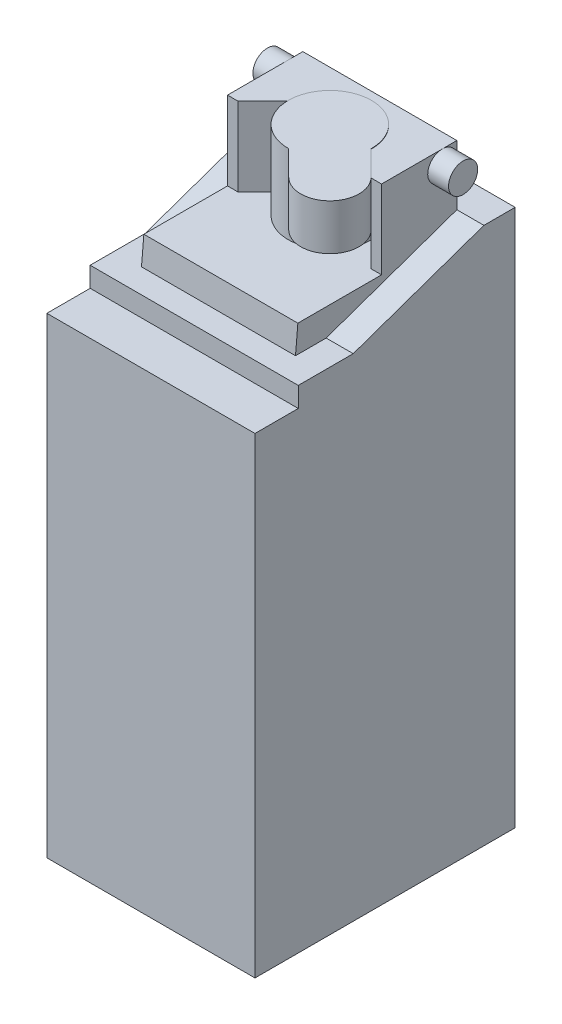
ISO-10303-21;
HEADER;
FILE_DESCRIPTION(('STEP AP214'),'2;1');
FILE_NAME('part.step','',(''),(''),'','','');
FILE_SCHEMA(('AUTOMOTIVE_DESIGN { 1 0 10303 214 1 1 1 1 }'));
ENDSEC;
DATA;
#1=APPLICATION_CONTEXT('core data for automotive mechanical design processes');
#2=APPLICATION_PROTOCOL_DEFINITION('international standard','automotive_design',2000,#1);
#3=PRODUCT_CONTEXT('',#1,'mechanical');
#4=PRODUCT('Part','Part','',(#3));
#5=PRODUCT_RELATED_PRODUCT_CATEGORY('part','',(#4));
#6=PRODUCT_DEFINITION_FORMATION('','',#4);
#7=PRODUCT_DEFINITION_CONTEXT('part definition',#1,'design');
#8=PRODUCT_DEFINITION('design','',#6,#7);
#9=PRODUCT_DEFINITION_SHAPE('','',#8);
#10=(LENGTH_UNIT() NAMED_UNIT(*) SI_UNIT(.MILLI.,.METRE.));
#11=(NAMED_UNIT(*) PLANE_ANGLE_UNIT() SI_UNIT($,.RADIAN.));
#12=(NAMED_UNIT(*) SI_UNIT($,.STERADIAN.) SOLID_ANGLE_UNIT());
#13=UNCERTAINTY_MEASURE_WITH_UNIT(LENGTH_MEASURE(1.E-05),#10,'distance_accuracy_value','');
#14=(GEOMETRIC_REPRESENTATION_CONTEXT(3) GLOBAL_UNCERTAINTY_ASSIGNED_CONTEXT((#13)) GLOBAL_UNIT_ASSIGNED_CONTEXT((#10,
#11,#12)) REPRESENTATION_CONTEXT('',''));
#15=CARTESIAN_POINT('',(0.,0.,0.));
#16=DIRECTION('',(0.,0.,1.));
#17=DIRECTION('',(1.,0.,0.));
#18=AXIS2_PLACEMENT_3D('',#15,#16,#17);
#19=CARTESIAN_POINT('',(3.7,28.7,-7.38));
#20=DIRECTION('',(0.,-1.,0.));
#21=DIRECTION('',(0.,0.,-1.));
#22=AXIS2_PLACEMENT_3D('',#19,#20,#21);
#23=PLANE('',#22);
#24=CARTESIAN_POINT('',(0.,28.7,-8.6));
#25=DIRECTION('',(0.,-1.,0.));
#26=DIRECTION('',(0.,0.,-1.));
#27=AXIS2_PLACEMENT_3D('',#24,#25,#26);
#28=CIRCLE('',#27,2.);
#29=CARTESIAN_POINT('',(1.99990098524558,28.7,-8.58009901475445));
#30=VERTEX_POINT('',#29);
#31=CARTESIAN_POINT('',(-1.99990098524558,28.7,-8.5800990147544));
#32=VERTEX_POINT('',#31);
#33=EDGE_CURVE('E39',#30,#32,#28,.F.);
#34=ORIENTED_EDGE('',*,*,#33,.F.);
#35=DIRECTION('',(-0.707106781186551,0.,-0.707106781186544));
#36=VECTOR('',#35,1.);
#37=CARTESIAN_POINT('',(0.,28.7,-10.58));
#38=LINE('',#37,#36);
#39=CARTESIAN_POINT('',(3.20000000000005,28.7,-7.38));
#40=VERTEX_POINT('',#39);
#41=EDGE_CURVE('E226',#40,#30,#38,.T.);
#42=ORIENTED_EDGE('',*,*,#41,.F.);
#43=DIRECTION('',(-1.,0.,0.));
#44=VECTOR('',#43,1.);
#45=CARTESIAN_POINT('',(3.7,28.7,-7.38));
#46=LINE('',#45,#44);
#47=CARTESIAN_POINT('',(3.7,28.7,-7.38));
#48=VERTEX_POINT('',#47);
#49=EDGE_CURVE('E327',#48,#40,#46,.T.);
#50=ORIENTED_EDGE('',*,*,#49,.F.);
#51=DIRECTION('',(0.,0.,1.));
#52=VECTOR('',#51,1.);
#53=CARTESIAN_POINT('',(3.7,28.7,-7.38));
#54=LINE('',#53,#52);
#55=CARTESIAN_POINT('',(3.7,28.7,-10.3));
#56=VERTEX_POINT('',#55);
#57=EDGE_CURVE('E322',#56,#48,#54,.T.);
#58=ORIENTED_EDGE('',*,*,#57,.F.);
#59=CARTESIAN_POINT('',(3.7,28.7,-11.));
#60=VERTEX_POINT('',#59);
#61=EDGE_CURVE('E323',#60,#56,#54,.T.);
#62=ORIENTED_EDGE('',*,*,#61,.F.);
#63=DIRECTION('',(-1.,0.,0.));
#64=VECTOR('',#63,1.);
#65=CARTESIAN_POINT('',(3.7,28.7,-11.));
#66=LINE('',#65,#64);
#67=CARTESIAN_POINT('',(-3.7,28.7,-11.));
#68=VERTEX_POINT('',#67);
#69=EDGE_CURVE('E330',#60,#68,#66,.T.);
#70=ORIENTED_EDGE('',*,*,#69,.T.);
#71=DIRECTION('',(0.,0.,1.));
#72=VECTOR('',#71,1.);
#73=CARTESIAN_POINT('',(-3.7,28.7,-7.38));
#74=LINE('',#73,#72);
#75=CARTESIAN_POINT('',(-3.7,28.7,-10.3));
#76=VERTEX_POINT('',#75);
#77=EDGE_CURVE('E259',#68,#76,#74,.T.);
#78=ORIENTED_EDGE('',*,*,#77,.T.);
#79=CARTESIAN_POINT('',(-3.7,28.7,-7.38));
#80=VERTEX_POINT('',#79);
#81=EDGE_CURVE('E258',#76,#80,#74,.T.);
#82=ORIENTED_EDGE('',*,*,#81,.T.);
#83=CARTESIAN_POINT('',(-3.19999999999995,28.7,-7.38));
#84=VERTEX_POINT('',#83);
#85=EDGE_CURVE('E326',#84,#80,#46,.T.);
#86=ORIENTED_EDGE('',*,*,#85,.F.);
#87=DIRECTION('',(-0.707106781186541,0.,0.707106781186554));
#88=VECTOR('',#87,1.);
#89=CARTESIAN_POINT('',(-3.19999999999995,28.7,-7.38));
#90=LINE('',#89,#88);
#91=EDGE_CURVE('E229',#32,#84,#90,.T.);
#92=ORIENTED_EDGE('',*,*,#91,.F.);
#93=EDGE_LOOP('',(#34,#42,#50,#58,#62,#70,#78,#82,#86,#92));
#94=FACE_BOUND('',#93,.T.);
#95=ADVANCED_FACE('F16',(#94),#23,.F.);
#96=CARTESIAN_POINT('',(3.7,24.92,-3.36));
#97=DIRECTION('',(0.,-1.,0.));
#98=DIRECTION('',(0.,0.,-1.));
#99=AXIS2_PLACEMENT_3D('',#96,#97,#98);
#100=PLANE('',#99);
#101=CARTESIAN_POINT('',(0.,24.92,-8.6));
#102=DIRECTION('',(0.,1.,0.));
#103=DIRECTION('',(0.,0.,1.));
#104=AXIS2_PLACEMENT_3D('',#101,#102,#103);
#105=CIRCLE('',#104,2.);
#106=CARTESIAN_POINT('',(-1.99990098524559,24.92,-8.5800990147544));
#107=VERTEX_POINT('',#106);
#108=CARTESIAN_POINT('',(1.99990098524558,24.92,-8.58009901475445));
#109=VERTEX_POINT('',#108);
#110=EDGE_CURVE('E214',#107,#109,#105,.T.);
#111=ORIENTED_EDGE('',*,*,#110,.F.);
#112=DIRECTION('',(-0.707106781186541,0.,0.707106781186554));
#113=VECTOR('',#112,1.);
#114=CARTESIAN_POINT('',(-3.19999999999996,24.92,-7.38));
#115=LINE('',#114,#113);
#116=CARTESIAN_POINT('',(-3.19999999999996,24.92,-7.38));
#117=VERTEX_POINT('',#116);
#118=EDGE_CURVE('E224',#107,#117,#115,.T.);
#119=ORIENTED_EDGE('',*,*,#118,.T.);
#120=DIRECTION('',(-1.,0.,0.));
#121=VECTOR('',#120,1.);
#122=CARTESIAN_POINT('',(3.7,24.92,-7.38));
#123=LINE('',#122,#121);
#124=CARTESIAN_POINT('',(-3.7,24.92,-7.38));
#125=VERTEX_POINT('',#124);
#126=EDGE_CURVE('E309',#117,#125,#123,.T.);
#127=ORIENTED_EDGE('',*,*,#126,.T.);
#128=DIRECTION('',(0.,0.,1.));
#129=VECTOR('',#128,1.);
#130=CARTESIAN_POINT('',(-3.7,24.92,-3.36));
#131=LINE('',#130,#129);
#132=CARTESIAN_POINT('',(-3.7,24.92,-3.36));
#133=VERTEX_POINT('',#132);
#134=EDGE_CURVE('E243',#125,#133,#131,.T.);
#135=ORIENTED_EDGE('',*,*,#134,.T.);
#136=DIRECTION('',(-1.,0.,0.));
#137=VECTOR('',#136,1.);
#138=CARTESIAN_POINT('',(3.7,24.92,-3.36));
#139=LINE('',#138,#137);
#140=CARTESIAN_POINT('',(3.7,24.92,-3.36));
#141=VERTEX_POINT('',#140);
#142=EDGE_CURVE('E307',#141,#133,#139,.T.);
#143=ORIENTED_EDGE('',*,*,#142,.F.);
#144=DIRECTION('',(0.,0.,1.));
#145=VECTOR('',#144,1.);
#146=CARTESIAN_POINT('',(3.7,24.92,-3.36));
#147=LINE('',#146,#145);
#148=CARTESIAN_POINT('',(3.7,24.92,-7.38));
#149=VERTEX_POINT('',#148);
#150=EDGE_CURVE('E302',#149,#141,#147,.T.);
#151=ORIENTED_EDGE('',*,*,#150,.F.);
#152=CARTESIAN_POINT('',(3.20000000000004,24.92,-7.38));
#153=VERTEX_POINT('',#152);
#154=EDGE_CURVE('E310',#149,#153,#123,.T.);
#155=ORIENTED_EDGE('',*,*,#154,.T.);
#156=DIRECTION('',(-0.707106781186551,0.,-0.707106781186544));
#157=VECTOR('',#156,1.);
#158=CARTESIAN_POINT('',(0.,24.92,-10.58));
#159=LINE('',#158,#157);
#160=EDGE_CURVE('E221',#153,#109,#159,.T.);
#161=ORIENTED_EDGE('',*,*,#160,.T.);
#162=EDGE_LOOP('',(#111,#119,#127,#135,#143,#151,#155,#161));
#163=FACE_BOUND('',#162,.T.);
#164=ADVANCED_FACE('F392',(#163),#100,.F.);
#165=CARTESIAN_POINT('',(0.,28.7,-10.58));
#166=DIRECTION('',(-0.707106781186544,0.,0.707106781186551));
#167=DIRECTION('',(0.707106781186551,0.,0.707106781186544));
#168=AXIS2_PLACEMENT_3D('',#165,#166,#167);
#169=PLANE('',#168);
#170=ORIENTED_EDGE('',*,*,#41,.T.);
#171=DIRECTION('',(0.,-1.,0.));
#172=VECTOR('',#171,1.);
#173=CARTESIAN_POINT('',(1.99990098524558,28.72,-8.58009901475445));
#174=LINE('',#173,#172);
#175=EDGE_CURVE('E218',#30,#109,#174,.T.);
#176=ORIENTED_EDGE('',*,*,#175,.T.);
#177=ORIENTED_EDGE('',*,*,#160,.F.);
#178=DIRECTION('',(0.,-1.,0.));
#179=VECTOR('',#178,1.);
#180=CARTESIAN_POINT('',(3.20000000000005,28.7,-7.38));
#181=LINE('',#180,#179);
#182=EDGE_CURVE('E234',#40,#153,#181,.T.);
#183=ORIENTED_EDGE('',*,*,#182,.F.);
#184=EDGE_LOOP('',(#170,#176,#177,#183));
#185=FACE_BOUND('',#184,.T.);
#186=ADVANCED_FACE('F397',(#185),#169,.T.);
#187=CARTESIAN_POINT('',(-3.19999999999995,28.7,-7.38));
#188=DIRECTION('',(0.707106781186554,0.,0.707106781186541));
#189=DIRECTION('',(0.707106781186541,0.,-0.707106781186554));
#190=AXIS2_PLACEMENT_3D('',#187,#188,#189);
#191=PLANE('',#190);
#192=ORIENTED_EDGE('',*,*,#118,.F.);
#193=DIRECTION('',(0.,-1.,0.));
#194=VECTOR('',#193,1.);
#195=CARTESIAN_POINT('',(-1.99990098524558,28.72,-8.5800990147544));
#196=LINE('',#195,#194);
#197=EDGE_CURVE('E24',#107,#32,#196,.F.);
#198=ORIENTED_EDGE('',*,*,#197,.T.);
#199=ORIENTED_EDGE('',*,*,#91,.T.);
#200=DIRECTION('',(0.,-1.,0.));
#201=VECTOR('',#200,1.);
#202=CARTESIAN_POINT('',(-3.19999999999995,28.7,-7.38));
#203=LINE('',#202,#201);
#204=EDGE_CURVE('E231',#84,#117,#203,.T.);
#205=ORIENTED_EDGE('',*,*,#204,.T.);
#206=EDGE_LOOP('',(#192,#198,#199,#205));
#207=FACE_BOUND('',#206,.T.);
#208=ADVANCED_FACE('F379',(#207),#191,.T.);
#209=CARTESIAN_POINT('',(3.7,21.2,-7.38));
#210=DIRECTION('',(0.,0.,-1.));
#211=DIRECTION('',(-1.,0.,0.));
#212=AXIS2_PLACEMENT_3D('',#209,#210,#211);
#213=PLANE('',#212);
#214=ORIENTED_EDGE('',*,*,#182,.T.);
#215=ORIENTED_EDGE('',*,*,#154,.F.);
#216=DIRECTION('',(0.,-1.,0.));
#217=VECTOR('',#216,1.);
#218=CARTESIAN_POINT('',(3.7,21.2,-7.38));
#219=LINE('',#218,#217);
#220=EDGE_CURVE('E316',#48,#149,#219,.T.);
#221=ORIENTED_EDGE('',*,*,#220,.F.);
#222=ORIENTED_EDGE('',*,*,#49,.T.);
#223=EDGE_LOOP('',(#214,#215,#221,#222));
#224=FACE_BOUND('',#223,.T.);
#225=ADVANCED_FACE('F402',(#224),#213,.F.);
#226=ORIENTED_EDGE('',*,*,#204,.F.);
#227=ORIENTED_EDGE('',*,*,#85,.T.);
#228=DIRECTION('',(0.,-1.,0.));
#229=VECTOR('',#228,1.);
#230=CARTESIAN_POINT('',(-3.7,21.2,-7.38));
#231=LINE('',#230,#229);
#232=EDGE_CURVE('E252',#80,#125,#231,.T.);
#233=ORIENTED_EDGE('',*,*,#232,.T.);
#234=ORIENTED_EDGE('',*,*,#126,.F.);
#235=EDGE_LOOP('',(#226,#227,#233,#234));
#236=FACE_BOUND('',#235,.T.);
#237=ADVANCED_FACE('F388',(#236),#213,.F.);
#238=CARTESIAN_POINT('',(3.7,28.7,-7.38));
#239=DIRECTION('',(-1.,0.,0.));
#240=DIRECTION('',(0.,0.,1.));
#241=AXIS2_PLACEMENT_3D('',#238,#239,#240);
#242=PLANE('',#241);
#243=CARTESIAN_POINT('',(3.7,28.,-10.3));
#244=DIRECTION('',(1.,0.,0.));
#245=DIRECTION('',(0.,0.,-1.));
#246=AXIS2_PLACEMENT_3D('',#243,#244,#245);
#247=CIRCLE('',#246,0.699999999999999);
#248=CARTESIAN_POINT('',(3.7,28.,-11.));
#249=VERTEX_POINT('',#248);
#250=EDGE_CURVE('E296',#249,#56,#247,.T.);
#251=ORIENTED_EDGE('',*,*,#250,.F.);
#252=DIRECTION('',(0.,1.,0.));
#253=VECTOR('',#252,1.);
#254=CARTESIAN_POINT('',(3.7,21.2,-11.));
#255=LINE('',#254,#253);
#256=EDGE_CURVE('E319',#249,#60,#255,.T.);
#257=ORIENTED_EDGE('',*,*,#256,.T.);
#258=ORIENTED_EDGE('',*,*,#61,.T.);
#259=EDGE_LOOP('',(#251,#257,#258));
#260=FACE_BOUND('',#259,.T.);
#261=ADVANCED_FACE('F439',(#260),#242,.F.);
#262=CARTESIAN_POINT('',(3.7,28.,-10.3));
#263=DIRECTION('',(-1.,0.,0.));
#264=DIRECTION('',(0.,0.,1.));
#265=AXIS2_PLACEMENT_3D('',#262,#263,#264);
#266=CIRCLE('',#265,0.699999999999999);
#267=EDGE_CURVE('E374',#56,#249,#266,.F.);
#268=ORIENTED_EDGE('',*,*,#267,.F.);
#269=ORIENTED_EDGE('',*,*,#57,.T.);
#270=ORIENTED_EDGE('',*,*,#220,.T.);
#271=ORIENTED_EDGE('',*,*,#150,.T.);
#272=DIRECTION('',(0.,-0.996194698091746,0.0871557427476543));
#273=VECTOR('',#272,1.);
#274=CARTESIAN_POINT('',(3.7,21.92,-3.09753400942224));
#275=LINE('',#274,#273);
#276=CARTESIAN_POINT('',(3.7,23.62,-3.2462647374163));
#277=VERTEX_POINT('',#276);
#278=EDGE_CURVE('E304',#141,#277,#275,.T.);
#279=ORIENTED_EDGE('',*,*,#278,.T.);
#280=DIRECTION('',(0.,0.,-1.));
#281=VECTOR('',#280,1.);
#282=CARTESIAN_POINT('',(3.7,23.62,-2.08));
#283=LINE('',#282,#281);
#284=CARTESIAN_POINT('',(3.7,23.62,-4.72));
#285=VERTEX_POINT('',#284);
#286=EDGE_CURVE('E313',#277,#285,#283,.T.);
#287=ORIENTED_EDGE('',*,*,#286,.T.);
#288=DIRECTION('',(0.,-0.33061817266007,0.943764601956927));
#289=VECTOR('',#288,1.);
#290=CARTESIAN_POINT('',(3.7,23.62,-4.72));
#291=LINE('',#290,#289);
#292=CARTESIAN_POINT('',(3.7,25.82,-11.));
#293=VERTEX_POINT('',#292);
#294=EDGE_CURVE('E370',#293,#285,#291,.T.);
#295=ORIENTED_EDGE('',*,*,#294,.F.);
#296=EDGE_CURVE('E320',#293,#249,#255,.T.);
#297=ORIENTED_EDGE('',*,*,#296,.T.);
#298=EDGE_LOOP('',(#268,#269,#270,#271,#279,#287,#295,#297));
#299=FACE_BOUND('',#298,.T.);
#300=ADVANCED_FACE('F405',(#299),#242,.F.);
#301=CARTESIAN_POINT('',(5.,23.62,-2.08));
#302=DIRECTION('',(0.,1.,0.));
#303=DIRECTION('',(0.,0.,1.));
#304=AXIS2_PLACEMENT_3D('',#301,#302,#303);
#305=PLANE('',#304);
#306=ORIENTED_EDGE('',*,*,#286,.F.);
#307=DIRECTION('',(-1.,0.,0.));
#308=VECTOR('',#307,1.);
#309=CARTESIAN_POINT('',(5.,23.62,-3.2462647374163));
#310=LINE('',#309,#308);
#311=CARTESIAN_POINT('',(-3.7,23.62,-3.2462647374163));
#312=VERTEX_POINT('',#311);
#313=EDGE_CURVE('E372',#277,#312,#310,.T.);
#314=ORIENTED_EDGE('',*,*,#313,.T.);
#315=DIRECTION('',(0.,0.,-1.));
#316=VECTOR('',#315,1.);
#317=CARTESIAN_POINT('',(-3.7,23.62,-2.08));
#318=LINE('',#317,#316);
#319=CARTESIAN_POINT('',(-3.7,23.62,-4.72));
#320=VERTEX_POINT('',#319);
#321=EDGE_CURVE('E249',#312,#320,#318,.T.);
#322=ORIENTED_EDGE('',*,*,#321,.T.);
#323=DIRECTION('',(1.,0.,0.));
#324=VECTOR('',#323,1.);
#325=CARTESIAN_POINT('',(-5.,23.62,-4.72));
#326=LINE('',#325,#324);
#327=CARTESIAN_POINT('',(-5.,23.62,-4.72));
#328=VERTEX_POINT('',#327);
#329=EDGE_CURVE('E271',#328,#320,#326,.T.);
#330=ORIENTED_EDGE('',*,*,#329,.F.);
#331=DIRECTION('',(0.,0.,-1.));
#332=VECTOR('',#331,1.);
#333=CARTESIAN_POINT('',(-5.,23.62,-2.08));
#334=LINE('',#333,#332);
#335=CARTESIAN_POINT('',(-5.,23.62,-2.08));
#336=VERTEX_POINT('',#335);
#337=EDGE_CURVE('E268',#336,#328,#334,.T.);
#338=ORIENTED_EDGE('',*,*,#337,.F.);
#339=DIRECTION('',(-1.,0.,0.));
#340=VECTOR('',#339,1.);
#341=CARTESIAN_POINT('',(5.,23.62,-2.08));
#342=LINE('',#341,#340);
#343=CARTESIAN_POINT('',(5.,23.62,-2.08));
#344=VERTEX_POINT('',#343);
#345=EDGE_CURVE('E344',#344,#336,#342,.T.);
#346=ORIENTED_EDGE('',*,*,#345,.F.);
#347=DIRECTION('',(0.,0.,-1.));
#348=VECTOR('',#347,1.);
#349=CARTESIAN_POINT('',(5.,23.62,-2.08));
#350=LINE('',#349,#348);
#351=CARTESIAN_POINT('',(5.,23.62,-4.72));
#352=VERTEX_POINT('',#351);
#353=EDGE_CURVE('E338',#344,#352,#350,.T.);
#354=ORIENTED_EDGE('',*,*,#353,.T.);
#355=DIRECTION('',(-1.,0.,0.));
#356=VECTOR('',#355,1.);
#357=CARTESIAN_POINT('',(5.,23.62,-4.72));
#358=LINE('',#357,#356);
#359=EDGE_CURVE('E341',#352,#285,#358,.T.);
#360=ORIENTED_EDGE('',*,*,#359,.T.);
#361=EDGE_LOOP('',(#306,#314,#322,#330,#338,#346,#354,#360));
#362=FACE_BOUND('',#361,.T.);
#363=ADVANCED_FACE('F412',(#362),#305,.T.);
#364=CARTESIAN_POINT('',(5.,23.62,-4.72));
#365=DIRECTION('',(0.,0.943764601956927,0.33061817266007));
#366=DIRECTION('',(0.,-0.33061817266007,0.943764601956927));
#367=AXIS2_PLACEMENT_3D('',#364,#365,#366);
#368=PLANE('',#367);
#369=ORIENTED_EDGE('',*,*,#294,.T.);
#370=ORIENTED_EDGE('',*,*,#359,.F.);
#371=DIRECTION('',(0.,0.33061817266007,-0.943764601956927));
#372=VECTOR('',#371,1.);
#373=CARTESIAN_POINT('',(5.,23.62,-4.72));
#374=LINE('',#373,#372);
#375=CARTESIAN_POINT('',(5.,25.82,-11.));
#376=VERTEX_POINT('',#375);
#377=EDGE_CURVE('E332',#352,#376,#374,.T.);
#378=ORIENTED_EDGE('',*,*,#377,.T.);
#379=DIRECTION('',(-1.,0.,0.));
#380=VECTOR('',#379,1.);
#381=CARTESIAN_POINT('',(5.,25.82,-11.));
#382=LINE('',#381,#380);
#383=EDGE_CURVE('E335',#376,#293,#382,.T.);
#384=ORIENTED_EDGE('',*,*,#383,.T.);
#385=EDGE_LOOP('',(#369,#370,#378,#384));
#386=FACE_BOUND('',#385,.T.);
#387=ADVANCED_FACE('F416',(#386),#368,.T.);
#388=CARTESIAN_POINT('',(5.,25.82,0.));
#389=DIRECTION('',(0.,-1.,0.));
#390=DIRECTION('',(0.,0.,-1.));
#391=AXIS2_PLACEMENT_3D('',#388,#389,#390);
#392=PLANE('',#391);
#393=ORIENTED_EDGE('',*,*,#383,.F.);
#394=DIRECTION('',(0.,0.,1.));
#395=VECTOR('',#394,1.);
#396=CARTESIAN_POINT('',(5.,25.82,0.));
#397=LINE('',#396,#395);
#398=CARTESIAN_POINT('',(5.,25.82,-12.5));
#399=VERTEX_POINT('',#398);
#400=EDGE_CURVE('E361',#399,#376,#397,.T.);
#401=ORIENTED_EDGE('',*,*,#400,.F.);
#402=DIRECTION('',(-1.,0.,0.));
#403=VECTOR('',#402,1.);
#404=CARTESIAN_POINT('',(5.,25.82,-12.5));
#405=LINE('',#404,#403);
#406=CARTESIAN_POINT('',(-5.,25.82,-12.5));
#407=VERTEX_POINT('',#406);
#408=EDGE_CURVE('E364',#399,#407,#405,.T.);
#409=ORIENTED_EDGE('',*,*,#408,.T.);
#410=DIRECTION('',(0.,0.,1.));
#411=VECTOR('',#410,1.);
#412=CARTESIAN_POINT('',(-5.,25.82,0.));
#413=LINE('',#412,#411);
#414=CARTESIAN_POINT('',(-5.,25.82,-11.));
#415=VERTEX_POINT('',#414);
#416=EDGE_CURVE('E288',#407,#415,#413,.T.);
#417=ORIENTED_EDGE('',*,*,#416,.T.);
#418=DIRECTION('',(1.,0.,0.));
#419=VECTOR('',#418,1.);
#420=CARTESIAN_POINT('',(-5.,25.82,-11.));
#421=LINE('',#420,#419);
#422=CARTESIAN_POINT('',(-3.7,25.82,-11.));
#423=VERTEX_POINT('',#422);
#424=EDGE_CURVE('E265',#415,#423,#421,.T.);
#425=ORIENTED_EDGE('',*,*,#424,.T.);
#426=EDGE_CURVE('E334',#293,#423,#382,.T.);
#427=ORIENTED_EDGE('',*,*,#426,.F.);
#428=EDGE_LOOP('',(#393,#401,#409,#417,#425,#427));
#429=FACE_BOUND('',#428,.T.);
#430=ADVANCED_FACE('F425',(#429),#392,.F.);
#431=CARTESIAN_POINT('',(5.,25.82,0.));
#432=DIRECTION('',(-1.,0.,0.));
#433=DIRECTION('',(0.,0.,1.));
#434=AXIS2_PLACEMENT_3D('',#431,#432,#433);
#435=PLANE('',#434);
#436=ORIENTED_EDGE('',*,*,#377,.F.);
#437=ORIENTED_EDGE('',*,*,#353,.F.);
#438=DIRECTION('',(0.,1.,0.));
#439=VECTOR('',#438,1.);
#440=CARTESIAN_POINT('',(5.,22.66,-2.08));
#441=LINE('',#440,#439);
#442=CARTESIAN_POINT('',(5.,22.66,-2.08));
#443=VERTEX_POINT('',#442);
#444=EDGE_CURVE('E348',#443,#344,#441,.T.);
#445=ORIENTED_EDGE('',*,*,#444,.F.);
#446=DIRECTION('',(0.,0.,-1.));
#447=VECTOR('',#446,1.);
#448=CARTESIAN_POINT('',(5.,22.66,0.));
#449=LINE('',#448,#447);
#450=CARTESIAN_POINT('',(5.,22.66,0.));
#451=VERTEX_POINT('',#450);
#452=EDGE_CURVE('E346',#451,#443,#449,.T.);
#453=ORIENTED_EDGE('',*,*,#452,.F.);
#454=DIRECTION('',(0.,-1.,0.));
#455=VECTOR('',#454,1.);
#456=CARTESIAN_POINT('',(5.,0.,0.));
#457=LINE('',#456,#455);
#458=CARTESIAN_POINT('',(5.,0.,0.));
#459=VERTEX_POINT('',#458);
#460=EDGE_CURVE('E355',#451,#459,#457,.T.);
#461=ORIENTED_EDGE('',*,*,#460,.T.);
#462=DIRECTION('',(0.,0.,-1.));
#463=VECTOR('',#462,1.);
#464=CARTESIAN_POINT('',(5.,0.,0.));
#465=LINE('',#464,#463);
#466=CARTESIAN_POINT('',(5.,0.,-12.5));
#467=VERTEX_POINT('',#466);
#468=EDGE_CURVE('E357',#459,#467,#465,.T.);
#469=ORIENTED_EDGE('',*,*,#468,.T.);
#470=DIRECTION('',(0.,1.,0.));
#471=VECTOR('',#470,1.);
#472=CARTESIAN_POINT('',(5.,0.,-12.5));
#473=LINE('',#472,#471);
#474=EDGE_CURVE('E359',#467,#399,#473,.T.);
#475=ORIENTED_EDGE('',*,*,#474,.T.);
#476=ORIENTED_EDGE('',*,*,#400,.T.);
#477=EDGE_LOOP('',(#436,#437,#445,#453,#461,#469,#475,#476));
#478=FACE_BOUND('',#477,.T.);
#479=ADVANCED_FACE('F419',(#478),#435,.F.);
#480=CARTESIAN_POINT('',(5.,22.66,-2.08));
#481=DIRECTION('',(0.,0.,1.));
#482=DIRECTION('',(1.,0.,0.));
#483=AXIS2_PLACEMENT_3D('',#480,#481,#482);
#484=PLANE('',#483);
#485=ORIENTED_EDGE('',*,*,#444,.T.);
#486=ORIENTED_EDGE('',*,*,#345,.T.);
#487=DIRECTION('',(0.,1.,0.));
#488=VECTOR('',#487,1.);
#489=CARTESIAN_POINT('',(-5.,22.66,-2.08));
#490=LINE('',#489,#488);
#491=CARTESIAN_POINT('',(-5.,22.66,-2.08));
#492=VERTEX_POINT('',#491);
#493=EDGE_CURVE('E276',#492,#336,#490,.T.);
#494=ORIENTED_EDGE('',*,*,#493,.F.);
#495=DIRECTION('',(-1.,0.,0.));
#496=VECTOR('',#495,1.);
#497=CARTESIAN_POINT('',(5.,22.66,-2.08));
#498=LINE('',#497,#496);
#499=EDGE_CURVE('E351',#443,#492,#498,.T.);
#500=ORIENTED_EDGE('',*,*,#499,.F.);
#501=EDGE_LOOP('',(#485,#486,#494,#500));
#502=FACE_BOUND('',#501,.T.);
#503=ADVANCED_FACE('F472',(#502),#484,.T.);
#504=CARTESIAN_POINT('',(5.,0.,0.));
#505=DIRECTION('',(0.,0.,-1.));
#506=DIRECTION('',(-1.,0.,0.));
#507=AXIS2_PLACEMENT_3D('',#504,#505,#506);
#508=PLANE('',#507);
#509=DIRECTION('',(-1.,0.,0.));
#510=VECTOR('',#509,1.);
#511=CARTESIAN_POINT('',(5.,22.66,0.));
#512=LINE('',#511,#510);
#513=CARTESIAN_POINT('',(-5.,22.66,0.));
#514=VERTEX_POINT('',#513);
#515=EDGE_CURVE('E353',#451,#514,#512,.T.);
#516=ORIENTED_EDGE('',*,*,#515,.T.);
#517=DIRECTION('',(0.,-1.,0.));
#518=VECTOR('',#517,1.);
#519=CARTESIAN_POINT('',(-5.,0.,0.));
#520=LINE('',#519,#518);
#521=CARTESIAN_POINT('',(-5.,0.,0.));
#522=VERTEX_POINT('',#521);
#523=EDGE_CURVE('E279',#514,#522,#520,.T.);
#524=ORIENTED_EDGE('',*,*,#523,.T.);
#525=DIRECTION('',(-1.,0.,0.));
#526=VECTOR('',#525,1.);
#527=CARTESIAN_POINT('',(5.,0.,0.));
#528=LINE('',#527,#526);
#529=EDGE_CURVE('E368',#459,#522,#528,.T.);
#530=ORIENTED_EDGE('',*,*,#529,.F.);
#531=ORIENTED_EDGE('',*,*,#460,.F.);
#532=EDGE_LOOP('',(#516,#524,#530,#531));
#533=FACE_BOUND('',#532,.T.);
#534=ADVANCED_FACE('F18',(#533),#508,.F.);
#535=CARTESIAN_POINT('',(5.,0.,0.));
#536=DIRECTION('',(0.,1.,0.));
#537=DIRECTION('',(0.,0.,1.));
#538=AXIS2_PLACEMENT_3D('',#535,#536,#537);
#539=PLANE('',#538);
#540=ORIENTED_EDGE('',*,*,#529,.T.);
#541=DIRECTION('',(0.,0.,-1.));
#542=VECTOR('',#541,1.);
#543=CARTESIAN_POINT('',(-5.,0.,0.));
#544=LINE('',#543,#542);
#545=CARTESIAN_POINT('',(-5.,0.,-12.5));
#546=VERTEX_POINT('',#545);
#547=EDGE_CURVE('E282',#522,#546,#544,.T.);
#548=ORIENTED_EDGE('',*,*,#547,.T.);
#549=DIRECTION('',(-1.,0.,0.));
#550=VECTOR('',#549,1.);
#551=CARTESIAN_POINT('',(5.,0.,-12.5));
#552=LINE('',#551,#550);
#553=EDGE_CURVE('E366',#467,#546,#552,.T.);
#554=ORIENTED_EDGE('',*,*,#553,.F.);
#555=ORIENTED_EDGE('',*,*,#468,.F.);
#556=EDGE_LOOP('',(#540,#548,#554,#555));
#557=FACE_BOUND('',#556,.T.);
#558=ADVANCED_FACE('F485',(#557),#539,.F.);
#559=CARTESIAN_POINT('',(5.,0.,-12.5));
#560=DIRECTION('',(0.,0.,1.));
#561=DIRECTION('',(1.,0.,0.));
#562=AXIS2_PLACEMENT_3D('',#559,#560,#561);
#563=PLANE('',#562);
#564=ORIENTED_EDGE('',*,*,#553,.T.);
#565=DIRECTION('',(0.,1.,0.));
#566=VECTOR('',#565,1.);
#567=CARTESIAN_POINT('',(-5.,0.,-12.5));
#568=LINE('',#567,#566);
#569=EDGE_CURVE('E285',#546,#407,#568,.T.);
#570=ORIENTED_EDGE('',*,*,#569,.T.);
#571=ORIENTED_EDGE('',*,*,#408,.F.);
#572=ORIENTED_EDGE('',*,*,#474,.F.);
#573=EDGE_LOOP('',(#564,#570,#571,#572));
#574=FACE_BOUND('',#573,.T.);
#575=ADVANCED_FACE('F478',(#574),#563,.F.);
#576=CARTESIAN_POINT('',(5.,22.66,0.));
#577=DIRECTION('',(0.,1.,0.));
#578=DIRECTION('',(0.,0.,1.));
#579=AXIS2_PLACEMENT_3D('',#576,#577,#578);
#580=PLANE('',#579);
#581=ORIENTED_EDGE('',*,*,#499,.T.);
#582=DIRECTION('',(0.,0.,-1.));
#583=VECTOR('',#582,1.);
#584=CARTESIAN_POINT('',(-5.,22.66,0.));
#585=LINE('',#584,#583);
#586=EDGE_CURVE('E273',#514,#492,#585,.T.);
#587=ORIENTED_EDGE('',*,*,#586,.F.);
#588=ORIENTED_EDGE('',*,*,#515,.F.);
#589=ORIENTED_EDGE('',*,*,#452,.T.);
#590=EDGE_LOOP('',(#581,#587,#588,#589));
#591=FACE_BOUND('',#590,.T.);
#592=ADVANCED_FACE('F465',(#591),#580,.T.);
#593=CARTESIAN_POINT('',(3.7,21.2,-11.));
#594=DIRECTION('',(0.,0.,1.));
#595=DIRECTION('',(1.,0.,0.));
#596=AXIS2_PLACEMENT_3D('',#593,#594,#595);
#597=PLANE('',#596);
#598=ORIENTED_EDGE('',*,*,#426,.T.);
#599=DIRECTION('',(0.,1.,0.));
#600=VECTOR('',#599,1.);
#601=CARTESIAN_POINT('',(-3.7,21.2,-11.));
#602=LINE('',#601,#600);
#603=CARTESIAN_POINT('',(-3.7,28.,-11.));
#604=VERTEX_POINT('',#603);
#605=EDGE_CURVE('E256',#423,#604,#602,.T.);
#606=ORIENTED_EDGE('',*,*,#605,.T.);
#607=EDGE_CURVE('E255',#604,#68,#602,.T.);
#608=ORIENTED_EDGE('',*,*,#607,.T.);
#609=ORIENTED_EDGE('',*,*,#69,.F.);
#610=ORIENTED_EDGE('',*,*,#256,.F.);
#611=ORIENTED_EDGE('',*,*,#296,.F.);
#612=EDGE_LOOP('',(#598,#606,#608,#609,#610,#611));
#613=FACE_BOUND('',#612,.T.);
#614=ADVANCED_FACE('F430',(#613),#597,.F.);
#615=CARTESIAN_POINT('',(3.7,21.92,-3.09753400942224));
#616=DIRECTION('',(0.,-0.0871557427476543,-0.996194698091746));
#617=DIRECTION('',(0.,0.996194698091746,-0.0871557427476544));
#618=AXIS2_PLACEMENT_3D('',#615,#616,#617);
#619=PLANE('',#618);
#620=ORIENTED_EDGE('',*,*,#313,.F.);
#621=ORIENTED_EDGE('',*,*,#278,.F.);
#622=ORIENTED_EDGE('',*,*,#142,.T.);
#623=DIRECTION('',(0.,-0.996194698091746,0.0871557427476543));
#624=VECTOR('',#623,1.);
#625=CARTESIAN_POINT('',(-3.7,21.92,-3.09753400942224));
#626=LINE('',#625,#624);
#627=EDGE_CURVE('E246',#133,#312,#626,.T.);
#628=ORIENTED_EDGE('',*,*,#627,.T.);
#629=EDGE_LOOP('',(#620,#621,#622,#628));
#630=FACE_BOUND('',#629,.T.);
#631=ADVANCED_FACE('F409',(#630),#619,.F.);
#632=CARTESIAN_POINT('',(4.69999999999999,28.,-10.3));
#633=DIRECTION('',(-1.,0.,0.));
#634=DIRECTION('',(0.,0.,1.));
#635=AXIS2_PLACEMENT_3D('',#632,#633,#634);
#636=CYLINDRICAL_SURFACE('',#635,0.699999999999999);
#637=CARTESIAN_POINT('',(4.69999999999999,28.,-10.3));
#638=DIRECTION('',(1.,0.,0.));
#639=DIRECTION('',(0.,0.,-1.));
#640=AXIS2_PLACEMENT_3D('',#637,#638,#639);
#641=CIRCLE('',#640,0.699999999999999);
#642=CARTESIAN_POINT('',(4.69999999999999,28.,-11.));
#643=VERTEX_POINT('',#642);
#644=EDGE_CURVE('E299',#643,#643,#641,.T.);
#645=ORIENTED_EDGE('',*,*,#644,.F.);
#646=EDGE_LOOP('',(#645));
#647=FACE_BOUND('',#646,.T.);
#648=ORIENTED_EDGE('',*,*,#250,.T.);
#649=ORIENTED_EDGE('',*,*,#267,.T.);
#650=EDGE_LOOP('',(#648,#649));
#651=FACE_BOUND('',#650,.T.);
#652=ADVANCED_FACE('F440',(#647,#651),#636,.T.);
#653=CARTESIAN_POINT('',(4.69999999999999,28.,-10.3));
#654=DIRECTION('',(1.,0.,0.));
#655=DIRECTION('',(0.,0.,-1.));
#656=AXIS2_PLACEMENT_3D('',#653,#654,#655);
#657=PLANE('',#656);
#658=ORIENTED_EDGE('',*,*,#644,.T.);
#659=EDGE_LOOP('',(#658));
#660=FACE_BOUND('',#659,.T.);
#661=ADVANCED_FACE('F442',(#660),#657,.T.);
#662=CARTESIAN_POINT('',(-3.7,28.7,-7.38));
#663=DIRECTION('',(1.,0.,0.));
#664=DIRECTION('',(0.,0.,1.));
#665=AXIS2_PLACEMENT_3D('',#662,#663,#664);
#666=PLANE('',#665);
#667=CARTESIAN_POINT('',(-3.7,28.,-10.3));
#668=DIRECTION('',(1.,0.,0.));
#669=DIRECTION('',(0.,0.,-1.));
#670=AXIS2_PLACEMENT_3D('',#667,#668,#669);
#671=CIRCLE('',#670,0.699999999999999);
#672=EDGE_CURVE('E237',#604,#76,#671,.T.);
#673=ORIENTED_EDGE('',*,*,#672,.T.);
#674=ORIENTED_EDGE('',*,*,#77,.F.);
#675=ORIENTED_EDGE('',*,*,#607,.F.);
#676=EDGE_LOOP('',(#673,#674,#675));
#677=FACE_BOUND('',#676,.T.);
#678=ADVANCED_FACE('F450',(#677),#666,.F.);
#679=CARTESIAN_POINT('',(-3.7,28.,-10.3));
#680=DIRECTION('',(-1.,0.,0.));
#681=DIRECTION('',(0.,0.,1.));
#682=AXIS2_PLACEMENT_3D('',#679,#680,#681);
#683=CIRCLE('',#682,0.699999999999999);
#684=EDGE_CURVE('E293',#76,#604,#683,.F.);
#685=ORIENTED_EDGE('',*,*,#684,.T.);
#686=ORIENTED_EDGE('',*,*,#605,.F.);
#687=DIRECTION('',(0.,-0.33061817266007,0.943764601956927));
#688=VECTOR('',#687,1.);
#689=CARTESIAN_POINT('',(-3.7,23.62,-4.72));
#690=LINE('',#689,#688);
#691=EDGE_CURVE('E290',#423,#320,#690,.T.);
#692=ORIENTED_EDGE('',*,*,#691,.T.);
#693=ORIENTED_EDGE('',*,*,#321,.F.);
#694=ORIENTED_EDGE('',*,*,#627,.F.);
#695=ORIENTED_EDGE('',*,*,#134,.F.);
#696=ORIENTED_EDGE('',*,*,#232,.F.);
#697=ORIENTED_EDGE('',*,*,#81,.F.);
#698=EDGE_LOOP('',(#685,#686,#692,#693,#694,#695,#696,#697));
#699=FACE_BOUND('',#698,.T.);
#700=ADVANCED_FACE('F510',(#699),#666,.F.);
#701=CARTESIAN_POINT('',(-5.,23.62,-4.72));
#702=DIRECTION('',(0.,0.943764601956927,0.33061817266007));
#703=DIRECTION('',(0.,-0.33061817266007,0.943764601956927));
#704=AXIS2_PLACEMENT_3D('',#701,#702,#703);
#705=PLANE('',#704);
#706=ORIENTED_EDGE('',*,*,#691,.F.);
#707=ORIENTED_EDGE('',*,*,#424,.F.);
#708=DIRECTION('',(0.,0.33061817266007,-0.943764601956927));
#709=VECTOR('',#708,1.);
#710=CARTESIAN_POINT('',(-5.,23.62,-4.72));
#711=LINE('',#710,#709);
#712=EDGE_CURVE('E262',#328,#415,#711,.T.);
#713=ORIENTED_EDGE('',*,*,#712,.F.);
#714=ORIENTED_EDGE('',*,*,#329,.T.);
#715=EDGE_LOOP('',(#706,#707,#713,#714));
#716=FACE_BOUND('',#715,.T.);
#717=ADVANCED_FACE('F507',(#716),#705,.T.);
#718=CARTESIAN_POINT('',(-5.,25.82,0.));
#719=DIRECTION('',(1.,0.,0.));
#720=DIRECTION('',(0.,0.,1.));
#721=AXIS2_PLACEMENT_3D('',#718,#719,#720);
#722=PLANE('',#721);
#723=ORIENTED_EDGE('',*,*,#712,.T.);
#724=ORIENTED_EDGE('',*,*,#416,.F.);
#725=ORIENTED_EDGE('',*,*,#569,.F.);
#726=ORIENTED_EDGE('',*,*,#547,.F.);
#727=ORIENTED_EDGE('',*,*,#523,.F.);
#728=ORIENTED_EDGE('',*,*,#586,.T.);
#729=ORIENTED_EDGE('',*,*,#493,.T.);
#730=ORIENTED_EDGE('',*,*,#337,.T.);
#731=EDGE_LOOP('',(#723,#724,#725,#726,#727,#728,#729,#730));
#732=FACE_BOUND('',#731,.T.);
#733=ADVANCED_FACE('F502',(#732),#722,.F.);
#734=CARTESIAN_POINT('',(-4.70000000000001,28.,-10.3));
#735=DIRECTION('',(1.,0.,0.));
#736=DIRECTION('',(0.,0.,1.));
#737=AXIS2_PLACEMENT_3D('',#734,#735,#736);
#738=CYLINDRICAL_SURFACE('',#737,0.699999999999999);
#739=CARTESIAN_POINT('',(-4.70000000000001,28.,-10.3));
#740=DIRECTION('',(1.,0.,0.));
#741=DIRECTION('',(0.,0.,-1.));
#742=AXIS2_PLACEMENT_3D('',#739,#740,#741);
#743=CIRCLE('',#742,0.699999999999999);
#744=CARTESIAN_POINT('',(-4.70000000000001,28.,-11.));
#745=VERTEX_POINT('',#744);
#746=EDGE_CURVE('E240',#745,#745,#743,.T.);
#747=ORIENTED_EDGE('',*,*,#746,.T.);
#748=EDGE_LOOP('',(#747));
#749=FACE_BOUND('',#748,.T.);
#750=ORIENTED_EDGE('',*,*,#672,.F.);
#751=ORIENTED_EDGE('',*,*,#684,.F.);
#752=EDGE_LOOP('',(#750,#751));
#753=FACE_BOUND('',#752,.T.);
#754=ADVANCED_FACE('F517',(#749,#753),#738,.T.);
#755=CARTESIAN_POINT('',(-4.70000000000001,28.,-10.3));
#756=DIRECTION('',(-1.,0.,0.));
#757=DIRECTION('',(0.,0.,-1.));
#758=AXIS2_PLACEMENT_3D('',#755,#756,#757);
#759=PLANE('',#758);
#760=ORIENTED_EDGE('',*,*,#746,.F.);
#761=EDGE_LOOP('',(#760));
#762=FACE_BOUND('',#761,.T.);
#763=ADVANCED_FACE('F519',(#762),#759,.T.);
#764=CARTESIAN_POINT('',(0.,28.72,-8.6));
#765=DIRECTION('',(0.,-1.,0.));
#766=DIRECTION('',(0.,0.,-1.));
#767=AXIS2_PLACEMENT_3D('',#764,#765,#766);
#768=CYLINDRICAL_SURFACE('',#767,2.);
#769=CARTESIAN_POINT('',(0.,28.72,-8.6));
#770=DIRECTION('',(0.,1.,0.));
#771=DIRECTION('',(0.,0.,1.));
#772=AXIS2_PLACEMENT_3D('',#769,#770,#771);
#773=CIRCLE('',#772,2.);
#774=CARTESIAN_POINT('',(1.99989998749737,28.72,-8.57999899982495));
#775=VERTEX_POINT('',#774);
#776=CARTESIAN_POINT('',(0.0200010001750283,28.72,-6.60010001250263));
#777=VERTEX_POINT('',#776);
#778=EDGE_CURVE('E186',#775,#777,#773,.T.);
#779=ORIENTED_EDGE('',*,*,#778,.F.);
#780=DIRECTION('',(0.,-1.,0.));
#781=VECTOR('',#780,1.);
#782=CARTESIAN_POINT('',(1.99989998749737,28.72,-8.57999899982495));
#783=LINE('',#782,#781);
#784=CARTESIAN_POINT('',(1.99989998749737,26.52,-8.57999899982495));
#785=VERTEX_POINT('',#784);
#786=EDGE_CURVE('E211',#775,#785,#783,.T.);
#787=ORIENTED_EDGE('',*,*,#786,.T.);
#788=CARTESIAN_POINT('',(0.,26.52,-8.6));
#789=DIRECTION('',(0.,1.,0.));
#790=DIRECTION('',(0.,0.,1.));
#791=AXIS2_PLACEMENT_3D('',#788,#789,#790);
#792=CIRCLE('',#791,2.);
#793=CARTESIAN_POINT('',(0.0200010001750287,26.52,-6.60010001250263));
#794=VERTEX_POINT('',#793);
#795=EDGE_CURVE('E11',#794,#785,#792,.T.);
#796=ORIENTED_EDGE('',*,*,#795,.F.);
#797=DIRECTION('',(0.,-1.,0.));
#798=VECTOR('',#797,1.);
#799=CARTESIAN_POINT('',(0.0200010001750279,28.72,-6.60010001250263));
#800=LINE('',#799,#798);
#801=EDGE_CURVE('E204',#794,#777,#800,.F.);
#802=ORIENTED_EDGE('',*,*,#801,.T.);
#803=EDGE_LOOP('',(#779,#787,#796,#802));
#804=FACE_BOUND('',#803,.T.);
#805=ORIENTED_EDGE('',*,*,#175,.F.);
#806=ORIENTED_EDGE('',*,*,#33,.T.);
#807=ORIENTED_EDGE('',*,*,#197,.F.);
#808=ORIENTED_EDGE('',*,*,#110,.T.);
#809=EDGE_LOOP('',(#805,#806,#807,#808));
#810=FACE_BOUND('',#809,.T.);
#811=ADVANCED_FACE('F395',(#804,#810),#768,.T.);
#812=CARTESIAN_POINT('',(0.,28.72,-8.6));
#813=DIRECTION('',(0.,1.,0.));
#814=DIRECTION('',(0.,0.,1.));
#815=AXIS2_PLACEMENT_3D('',#812,#813,#814);
#816=PLANE('',#815);
#817=ORIENTED_EDGE('',*,*,#778,.T.);
#818=DIRECTION('',(0.707106781186544,0.,0.707106781186551));
#819=VECTOR('',#818,1.);
#820=CARTESIAN_POINT('',(-0.989949493661173,28.72,-7.61005050633884));
#821=LINE('',#820,#819);
#822=CARTESIAN_POINT('',(1.20208152801711,28.72,-5.41801948466053));
#823=VERTEX_POINT('',#822);
#824=EDGE_CURVE('E181',#777,#823,#821,.T.);
#825=ORIENTED_EDGE('',*,*,#824,.T.);
#826=CARTESIAN_POINT('',(2.19203102167829,28.72,-6.40796897832169));
#827=DIRECTION('',(0.,1.,0.));
#828=DIRECTION('',(0.,0.,-1.));
#829=AXIS2_PLACEMENT_3D('',#826,#827,#828);
#830=CIRCLE('',#829,1.4);
#831=CARTESIAN_POINT('',(3.18198051533946,28.72,-7.39791847198285));
#832=VERTEX_POINT('',#831);
#833=EDGE_CURVE('E184',#823,#832,#830,.T.);
#834=ORIENTED_EDGE('',*,*,#833,.T.);
#835=DIRECTION('',(-0.707106781186544,0.,-0.707106781186551));
#836=VECTOR('',#835,1.);
#837=CARTESIAN_POINT('',(0.989949493661172,28.72,-9.58994949366116));
#838=LINE('',#837,#836);
#839=EDGE_CURVE('E31',#832,#775,#838,.T.);
#840=ORIENTED_EDGE('',*,*,#839,.T.);
#841=EDGE_LOOP('',(#817,#825,#834,#840));
#842=FACE_BOUND('',#841,.T.);
#843=ADVANCED_FACE('F183',(#842),#816,.T.);
#844=CARTESIAN_POINT('',(2.19203102167829,26.52,-6.40796897832169));
#845=DIRECTION('',(0.,1.,0.));
#846=DIRECTION('',(0.,0.,1.));
#847=AXIS2_PLACEMENT_3D('',#844,#845,#846);
#848=PLANE('',#847);
#849=DIRECTION('',(0.707106781186544,0.,0.707106781186551));
#850=VECTOR('',#849,1.);
#851=CARTESIAN_POINT('',(-0.989949493661172,26.52,-7.61005050633884));
#852=LINE('',#851,#850);
#853=CARTESIAN_POINT('',(1.20208152801711,26.52,-5.41801948466053));
#854=VERTEX_POINT('',#853);
#855=EDGE_CURVE('E201',#794,#854,#852,.T.);
#856=ORIENTED_EDGE('',*,*,#855,.F.);
#857=ORIENTED_EDGE('',*,*,#795,.T.);
#858=DIRECTION('',(-0.707106781186544,0.,-0.707106781186551));
#859=VECTOR('',#858,1.);
#860=CARTESIAN_POINT('',(0.989949493661172,26.52,-9.58994949366116));
#861=LINE('',#860,#859);
#862=CARTESIAN_POINT('',(3.18198051533946,26.52,-7.39791847198285));
#863=VERTEX_POINT('',#862);
#864=EDGE_CURVE('E202',#863,#785,#861,.T.);
#865=ORIENTED_EDGE('',*,*,#864,.F.);
#866=CARTESIAN_POINT('',(2.19203102167829,26.52,-6.40796897832169));
#867=DIRECTION('',(0.,1.,0.));
#868=DIRECTION('',(0.,0.,1.));
#869=AXIS2_PLACEMENT_3D('',#866,#867,#868);
#870=CIRCLE('',#869,1.4);
#871=EDGE_CURVE('E207',#854,#863,#870,.T.);
#872=ORIENTED_EDGE('',*,*,#871,.F.);
#873=EDGE_LOOP('',(#856,#857,#865,#872));
#874=FACE_BOUND('',#873,.T.);
#875=ADVANCED_FACE('F688',(#874),#848,.F.);
#876=CARTESIAN_POINT('',(0.989949493661172,26.52,-9.58994949366116));
#877=DIRECTION('',(0.707106781186551,0.,-0.707106781186544));
#878=DIRECTION('',(-0.707106781186544,0.,-0.707106781186551));
#879=AXIS2_PLACEMENT_3D('',#876,#877,#878);
#880=PLANE('',#879);
#881=ORIENTED_EDGE('',*,*,#786,.F.);
#882=ORIENTED_EDGE('',*,*,#839,.F.);
#883=DIRECTION('',(0.,1.,0.));
#884=VECTOR('',#883,1.);
#885=CARTESIAN_POINT('',(3.18198051533946,26.52,-7.39791847198285));
#886=LINE('',#885,#884);
#887=EDGE_CURVE('E197',#863,#832,#886,.T.);
#888=ORIENTED_EDGE('',*,*,#887,.F.);
#889=ORIENTED_EDGE('',*,*,#864,.T.);
#890=EDGE_LOOP('',(#881,#882,#888,#889));
#891=FACE_BOUND('',#890,.T.);
#892=ADVANCED_FACE('F691',(#891),#880,.T.);
#893=CARTESIAN_POINT('',(-0.989949493661172,26.52,-7.61005050633884));
#894=DIRECTION('',(-0.707106781186551,0.,0.707106781186544));
#895=DIRECTION('',(0.707106781186544,0.,0.707106781186551));
#896=AXIS2_PLACEMENT_3D('',#893,#894,#895);
#897=PLANE('',#896);
#898=ORIENTED_EDGE('',*,*,#801,.F.);
#899=ORIENTED_EDGE('',*,*,#855,.T.);
#900=DIRECTION('',(0.,1.,0.));
#901=VECTOR('',#900,1.);
#902=CARTESIAN_POINT('',(1.20208152801711,26.52,-5.41801948466053));
#903=LINE('',#902,#901);
#904=EDGE_CURVE('E194',#854,#823,#903,.T.);
#905=ORIENTED_EDGE('',*,*,#904,.T.);
#906=ORIENTED_EDGE('',*,*,#824,.F.);
#907=EDGE_LOOP('',(#898,#899,#905,#906));
#908=FACE_BOUND('',#907,.T.);
#909=ADVANCED_FACE('F199',(#908),#897,.T.);
#910=CARTESIAN_POINT('',(2.19203102167829,26.52,-6.40796897832169));
#911=DIRECTION('',(0.,1.,0.));
#912=DIRECTION('',(0.,0.,1.));
#913=AXIS2_PLACEMENT_3D('',#910,#911,#912);
#914=CYLINDRICAL_SURFACE('',#913,1.4);
#915=ORIENTED_EDGE('',*,*,#833,.F.);
#916=ORIENTED_EDGE('',*,*,#904,.F.);
#917=ORIENTED_EDGE('',*,*,#871,.T.);
#918=ORIENTED_EDGE('',*,*,#887,.T.);
#919=EDGE_LOOP('',(#915,#916,#917,#918));
#920=FACE_BOUND('',#919,.T.);
#921=ADVANCED_FACE('F193',(#920),#914,.T.);
#922=CLOSED_SHELL('',(#95,#164,#186,#208,#225,#237,#261,#300,#363,#387,#430,#479,#503,#534,#558,
#575,#592,#614,#631,#652,#661,#678,#700,#717,#733,#754,#763,#811,#843,#875,#892,#909,#921));
#923=MANIFOLD_SOLID_BREP('B1',#922);
#924=ADVANCED_BREP_SHAPE_REPRESENTATION('',(#18,#923),#14);
#925=SHAPE_DEFINITION_REPRESENTATION(#9,#924);
ENDSEC;
END-ISO-10303-21;
